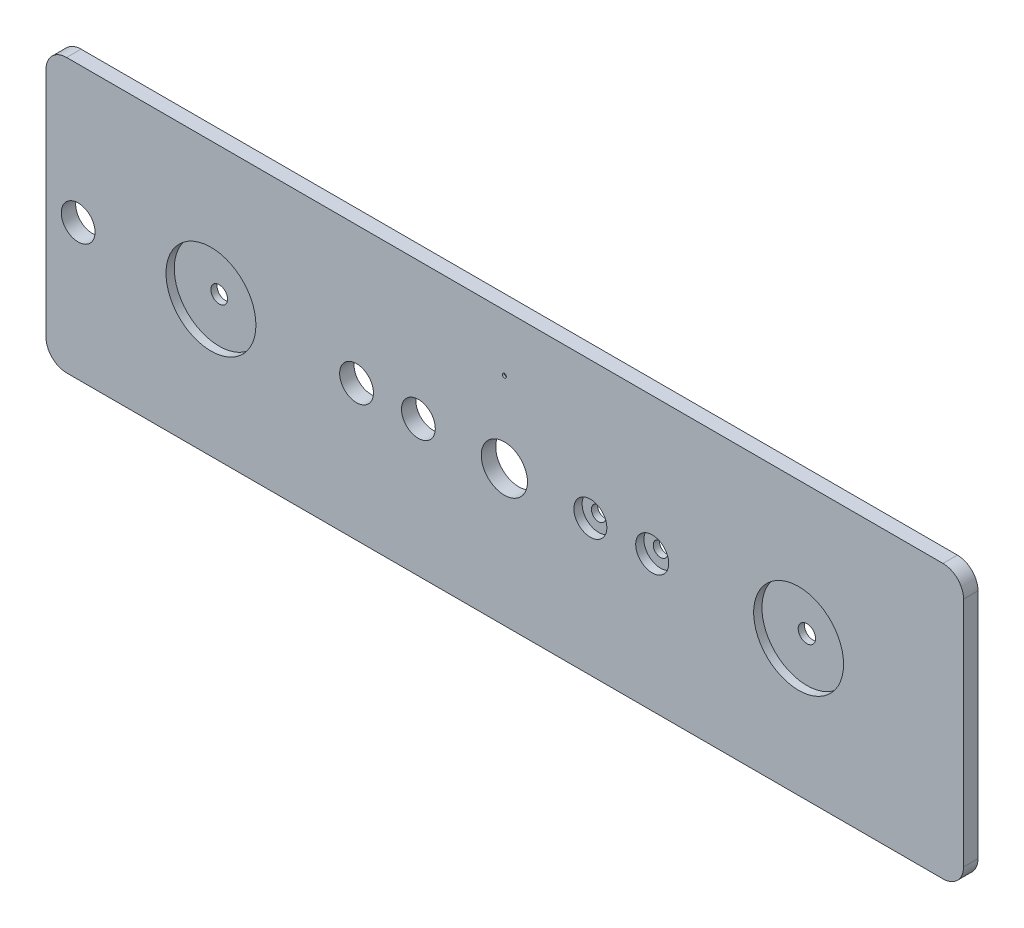
ISO-10303-21;
HEADER;
FILE_DESCRIPTION(('STEP AP214'),'2;1');
FILE_NAME('part.step','',(''),(''),'','','');
FILE_SCHEMA(('AUTOMOTIVE_DESIGN { 1 0 10303 214 1 1 1 1 }'));
ENDSEC;
DATA;
#1=APPLICATION_CONTEXT('core data for automotive mechanical design processes');
#2=APPLICATION_PROTOCOL_DEFINITION('international standard','automotive_design',2000,#1);
#3=PRODUCT_CONTEXT('',#1,'mechanical');
#4=PRODUCT('Part','Part','',(#3));
#5=PRODUCT_RELATED_PRODUCT_CATEGORY('part','',(#4));
#6=PRODUCT_DEFINITION_FORMATION('','',#4);
#7=PRODUCT_DEFINITION_CONTEXT('part definition',#1,'design');
#8=PRODUCT_DEFINITION('design','',#6,#7);
#9=PRODUCT_DEFINITION_SHAPE('','',#8);
#10=(LENGTH_UNIT() NAMED_UNIT(*) SI_UNIT(.MILLI.,.METRE.));
#11=(NAMED_UNIT(*) PLANE_ANGLE_UNIT() SI_UNIT($,.RADIAN.));
#12=(NAMED_UNIT(*) SI_UNIT($,.STERADIAN.) SOLID_ANGLE_UNIT());
#13=UNCERTAINTY_MEASURE_WITH_UNIT(LENGTH_MEASURE(1.E-05),#10,'distance_accuracy_value','');
#14=(GEOMETRIC_REPRESENTATION_CONTEXT(3) GLOBAL_UNCERTAINTY_ASSIGNED_CONTEXT((#13)) GLOBAL_UNIT_ASSIGNED_CONTEXT((#10,
#11,#12)) REPRESENTATION_CONTEXT('',''));
#15=CARTESIAN_POINT('',(0.,0.,0.));
#16=DIRECTION('',(0.,0.,1.));
#17=DIRECTION('',(1.,0.,0.));
#18=AXIS2_PLACEMENT_3D('',#15,#16,#17);
#19=CARTESIAN_POINT('',(222.3,105.,7.));
#20=DIRECTION('',(0.,0.,-1.));
#21=DIRECTION('',(-1.,0.,0.));
#22=AXIS2_PLACEMENT_3D('',#19,#20,#21);
#23=CYLINDRICAL_SURFACE('',#22,0.999999999999998);
#24=CARTESIAN_POINT('',(222.3,105.,7.));
#25=DIRECTION('',(0.,0.,1.));
#26=DIRECTION('',(1.,0.,0.));
#27=AXIS2_PLACEMENT_3D('',#24,#25,#26);
#28=CIRCLE('',#27,0.999999999999998);
#29=CARTESIAN_POINT('',(223.3,105.,7.));
#30=VERTEX_POINT('',#29);
#31=EDGE_CURVE('E204',#30,#30,#28,.T.);
#32=ORIENTED_EDGE('',*,*,#31,.T.);
#33=EDGE_LOOP('',(#32));
#34=FACE_BOUND('',#33,.T.);
#35=CARTESIAN_POINT('',(222.3,105.,6.));
#36=DIRECTION('',(0.,0.,-1.));
#37=DIRECTION('',(-1.,0.,0.));
#38=AXIS2_PLACEMENT_3D('',#35,#36,#37);
#39=CIRCLE('',#38,0.999999999999998);
#40=CARTESIAN_POINT('',(221.3,105.,6.));
#41=VERTEX_POINT('',#40);
#42=EDGE_CURVE('E35',#41,#41,#39,.T.);
#43=ORIENTED_EDGE('',*,*,#42,.T.);
#44=EDGE_LOOP('',(#43));
#45=FACE_BOUND('',#44,.T.);
#46=ADVANCED_FACE('F31',(#34,#45),#23,.F.);
#47=CARTESIAN_POINT('',(294.,66.,7.));
#48=DIRECTION('',(0.,0.,-1.));
#49=DIRECTION('',(-1.,0.,0.));
#50=AXIS2_PLACEMENT_3D('',#47,#48,#49);
#51=CYLINDRICAL_SURFACE('',#50,3.50000000000002);
#52=CARTESIAN_POINT('',(294.,66.,0.));
#53=DIRECTION('',(0.,0.,1.));
#54=DIRECTION('',(1.,0.,0.));
#55=AXIS2_PLACEMENT_3D('',#52,#53,#54);
#56=CIRCLE('',#55,3.50000000000002);
#57=CARTESIAN_POINT('',(297.5,66.,0.));
#58=VERTEX_POINT('',#57);
#59=EDGE_CURVE('E222',#58,#58,#56,.T.);
#60=ORIENTED_EDGE('',*,*,#59,.F.);
#61=EDGE_LOOP('',(#60));
#62=FACE_BOUND('',#61,.T.);
#63=CARTESIAN_POINT('',(294.,66.,3.));
#64=DIRECTION('',(0.,0.,1.));
#65=DIRECTION('',(1.,0.,0.));
#66=AXIS2_PLACEMENT_3D('',#63,#64,#65);
#67=CIRCLE('',#66,3.50000000000002);
#68=CARTESIAN_POINT('',(297.5,66.,3.));
#69=VERTEX_POINT('',#68);
#70=EDGE_CURVE('E172',#69,#69,#67,.T.);
#71=ORIENTED_EDGE('',*,*,#70,.T.);
#72=EDGE_LOOP('',(#71));
#73=FACE_BOUND('',#72,.T.);
#74=ADVANCED_FACE('F275',(#62,#73),#51,.F.);
#75=CARTESIAN_POINT('',(264.,66.,7.));
#76=DIRECTION('',(0.,0.,-1.));
#77=DIRECTION('',(-1.,0.,0.));
#78=AXIS2_PLACEMENT_3D('',#75,#76,#77);
#79=CYLINDRICAL_SURFACE('',#78,3.50000000000002);
#80=CARTESIAN_POINT('',(264.,66.,0.));
#81=DIRECTION('',(0.,0.,1.));
#82=DIRECTION('',(1.,0.,0.));
#83=AXIS2_PLACEMENT_3D('',#80,#81,#82);
#84=CIRCLE('',#83,3.50000000000002);
#85=CARTESIAN_POINT('',(267.5,66.,0.));
#86=VERTEX_POINT('',#85);
#87=EDGE_CURVE('E227',#86,#86,#84,.T.);
#88=ORIENTED_EDGE('',*,*,#87,.F.);
#89=EDGE_LOOP('',(#88));
#90=FACE_BOUND('',#89,.T.);
#91=CARTESIAN_POINT('',(264.,66.,3.));
#92=DIRECTION('',(0.,0.,1.));
#93=DIRECTION('',(1.,0.,0.));
#94=AXIS2_PLACEMENT_3D('',#91,#92,#93);
#95=CIRCLE('',#94,3.50000000000002);
#96=CARTESIAN_POINT('',(267.5,66.,3.));
#97=VERTEX_POINT('',#96);
#98=EDGE_CURVE('E168',#97,#97,#95,.T.);
#99=ORIENTED_EDGE('',*,*,#98,.T.);
#100=EDGE_LOOP('',(#99));
#101=FACE_BOUND('',#100,.T.);
#102=ADVANCED_FACE('F281',(#90,#101),#79,.F.);
#103=CARTESIAN_POINT('',(365.,66.,7.));
#104=DIRECTION('',(0.,0.,-1.));
#105=DIRECTION('',(-1.,0.,0.));
#106=AXIS2_PLACEMENT_3D('',#103,#104,#105);
#107=CYLINDRICAL_SURFACE('',#106,4.19999999999998);
#108=CARTESIAN_POINT('',(365.,66.,0.));
#109=DIRECTION('',(0.,0.,1.));
#110=DIRECTION('',(1.,0.,0.));
#111=AXIS2_PLACEMENT_3D('',#108,#109,#110);
#112=CIRCLE('',#111,4.19999999999998);
#113=CARTESIAN_POINT('',(369.2,66.,0.));
#114=VERTEX_POINT('',#113);
#115=EDGE_CURVE('E213',#114,#114,#112,.T.);
#116=ORIENTED_EDGE('',*,*,#115,.F.);
#117=EDGE_LOOP('',(#116));
#118=FACE_BOUND('',#117,.T.);
#119=CARTESIAN_POINT('',(365.,66.,3.));
#120=DIRECTION('',(0.,0.,1.));
#121=DIRECTION('',(1.,0.,0.));
#122=AXIS2_PLACEMENT_3D('',#119,#120,#121);
#123=CIRCLE('',#122,4.19999999999998);
#124=CARTESIAN_POINT('',(369.2,66.,3.));
#125=VERTEX_POINT('',#124);
#126=EDGE_CURVE('E163',#125,#125,#123,.T.);
#127=ORIENTED_EDGE('',*,*,#126,.T.);
#128=EDGE_LOOP('',(#127));
#129=FACE_BOUND('',#128,.T.);
#130=ADVANCED_FACE('F293',(#118,#129),#107,.F.);
#131=CARTESIAN_POINT('',(80.,66.,7.));
#132=DIRECTION('',(0.,0.,-1.));
#133=DIRECTION('',(-1.,0.,0.));
#134=AXIS2_PLACEMENT_3D('',#131,#132,#133);
#135=CYLINDRICAL_SURFACE('',#134,4.05);
#136=CARTESIAN_POINT('',(80.,66.,0.));
#137=DIRECTION('',(0.,0.,1.));
#138=DIRECTION('',(1.,0.,0.));
#139=AXIS2_PLACEMENT_3D('',#136,#137,#138);
#140=CIRCLE('',#139,4.05);
#141=CARTESIAN_POINT('',(84.05,66.,0.));
#142=VERTEX_POINT('',#141);
#143=EDGE_CURVE('E230',#142,#142,#140,.T.);
#144=ORIENTED_EDGE('',*,*,#143,.F.);
#145=EDGE_LOOP('',(#144));
#146=FACE_BOUND('',#145,.T.);
#147=CARTESIAN_POINT('',(80.,66.,3.));
#148=DIRECTION('',(0.,0.,1.));
#149=DIRECTION('',(1.,0.,0.));
#150=AXIS2_PLACEMENT_3D('',#147,#148,#149);
#151=CIRCLE('',#150,4.05);
#152=CARTESIAN_POINT('',(84.05,66.,3.));
#153=VERTEX_POINT('',#152);
#154=EDGE_CURVE('E158',#153,#153,#151,.T.);
#155=ORIENTED_EDGE('',*,*,#154,.T.);
#156=EDGE_LOOP('',(#155));
#157=FACE_BOUND('',#156,.T.);
#158=ADVANCED_FACE('F296',(#146,#157),#135,.F.);
#159=CARTESIAN_POINT('',(10.,122.5,7.));
#160=DIRECTION('',(0.,0.,-1.));
#161=DIRECTION('',(-1.,0.,0.));
#162=AXIS2_PLACEMENT_3D('',#159,#160,#161);
#163=PLANE('',#162);
#164=CARTESIAN_POINT('',(294.,66.,7.));
#165=DIRECTION('',(0.,0.,1.));
#166=DIRECTION('',(1.,0.,0.));
#167=AXIS2_PLACEMENT_3D('',#164,#165,#166);
#168=CIRCLE('',#167,7.99999999999999);
#169=CARTESIAN_POINT('',(302.,66.,7.));
#170=VERTEX_POINT('',#169);
#171=EDGE_CURVE('E181',#170,#170,#168,.T.);
#172=ORIENTED_EDGE('',*,*,#171,.F.);
#173=EDGE_LOOP('',(#172));
#174=FACE_BOUND('',#173,.T.);
#175=CARTESIAN_POINT('',(264.,66.,7.));
#176=DIRECTION('',(0.,0.,1.));
#177=DIRECTION('',(1.,0.,0.));
#178=AXIS2_PLACEMENT_3D('',#175,#176,#177);
#179=CIRCLE('',#178,7.99999999999999);
#180=CARTESIAN_POINT('',(272.,66.,7.));
#181=VERTEX_POINT('',#180);
#182=EDGE_CURVE('E174',#181,#181,#179,.T.);
#183=ORIENTED_EDGE('',*,*,#182,.F.);
#184=EDGE_LOOP('',(#183));
#185=FACE_BOUND('',#184,.T.);
#186=CARTESIAN_POINT('',(365.,66.,7.));
#187=DIRECTION('',(0.,0.,1.));
#188=DIRECTION('',(1.,0.,0.));
#189=AXIS2_PLACEMENT_3D('',#186,#187,#188);
#190=CIRCLE('',#189,21.8);
#191=CARTESIAN_POINT('',(386.8,66.,7.));
#192=VERTEX_POINT('',#191);
#193=EDGE_CURVE('E170',#192,#192,#190,.T.);
#194=ORIENTED_EDGE('',*,*,#193,.F.);
#195=EDGE_LOOP('',(#194));
#196=FACE_BOUND('',#195,.T.);
#197=CARTESIAN_POINT('',(80.,66.,7.));
#198=DIRECTION('',(0.,0.,1.));
#199=DIRECTION('',(1.,0.,0.));
#200=AXIS2_PLACEMENT_3D('',#197,#198,#199);
#201=CIRCLE('',#200,21.8);
#202=CARTESIAN_POINT('',(101.8,66.,7.));
#203=VERTEX_POINT('',#202);
#204=EDGE_CURVE('E166',#203,#203,#201,.T.);
#205=ORIENTED_EDGE('',*,*,#204,.F.);
#206=EDGE_LOOP('',(#205));
#207=FACE_BOUND('',#206,.T.);
#208=ORIENTED_EDGE('',*,*,#31,.F.);
#209=EDGE_LOOP('',(#208));
#210=FACE_BOUND('',#209,.T.);
#211=CARTESIAN_POINT('',(10.,122.5,7.));
#212=DIRECTION('',(0.,0.,1.));
#213=DIRECTION('',(-1.,0.,0.));
#214=AXIS2_PLACEMENT_3D('',#211,#212,#213);
#215=CIRCLE('',#214,10.);
#216=CARTESIAN_POINT('',(10.0000000000001,132.5,7.));
#217=VERTEX_POINT('',#216);
#218=CARTESIAN_POINT('',(0.,122.5,7.));
#219=VERTEX_POINT('',#218);
#220=EDGE_CURVE('E146',#217,#219,#215,.T.);
#221=ORIENTED_EDGE('',*,*,#220,.T.);
#222=DIRECTION('',(0.,-1.,0.));
#223=VECTOR('',#222,1.);
#224=CARTESIAN_POINT('',(0.,10.0000000000001,7.));
#225=LINE('',#224,#223);
#226=CARTESIAN_POINT('',(0.,10.0000000000001,7.));
#227=VERTEX_POINT('',#226);
#228=EDGE_CURVE('E93',#219,#227,#225,.T.);
#229=ORIENTED_EDGE('',*,*,#228,.T.);
#230=CARTESIAN_POINT('',(10.,10.,7.));
#231=DIRECTION('',(0.,0.,1.));
#232=DIRECTION('',(-1.,0.,0.));
#233=AXIS2_PLACEMENT_3D('',#230,#231,#232);
#234=CIRCLE('',#233,10.);
#235=CARTESIAN_POINT('',(10.0000000000001,0.,7.));
#236=VERTEX_POINT('',#235);
#237=EDGE_CURVE('E240',#227,#236,#234,.T.);
#238=ORIENTED_EDGE('',*,*,#237,.T.);
#239=DIRECTION('',(1.,0.,0.));
#240=VECTOR('',#239,1.);
#241=CARTESIAN_POINT('',(10.0000000000001,0.,7.));
#242=LINE('',#241,#240);
#243=CARTESIAN_POINT('',(435.,0.,7.));
#244=VERTEX_POINT('',#243);
#245=EDGE_CURVE('E242',#236,#244,#242,.T.);
#246=ORIENTED_EDGE('',*,*,#245,.T.);
#247=CARTESIAN_POINT('',(435.,10.,7.));
#248=DIRECTION('',(0.,0.,1.));
#249=DIRECTION('',(1.,0.,0.));
#250=AXIS2_PLACEMENT_3D('',#247,#248,#249);
#251=CIRCLE('',#250,10.);
#252=CARTESIAN_POINT('',(445.,10.0000000000001,7.));
#253=VERTEX_POINT('',#252);
#254=EDGE_CURVE('E113',#244,#253,#251,.T.);
#255=ORIENTED_EDGE('',*,*,#254,.T.);
#256=DIRECTION('',(0.,1.,0.));
#257=VECTOR('',#256,1.);
#258=CARTESIAN_POINT('',(445.,10.0000000000001,7.));
#259=LINE('',#258,#257);
#260=CARTESIAN_POINT('',(445.,122.5,7.));
#261=VERTEX_POINT('',#260);
#262=EDGE_CURVE('E106',#253,#261,#259,.T.);
#263=ORIENTED_EDGE('',*,*,#262,.T.);
#264=CARTESIAN_POINT('',(435.,122.5,7.));
#265=DIRECTION('',(0.,0.,1.));
#266=DIRECTION('',(-1.,0.,0.));
#267=AXIS2_PLACEMENT_3D('',#264,#265,#266);
#268=CIRCLE('',#267,10.);
#269=CARTESIAN_POINT('',(435.,132.5,7.));
#270=VERTEX_POINT('',#269);
#271=EDGE_CURVE('E111',#261,#270,#268,.T.);
#272=ORIENTED_EDGE('',*,*,#271,.T.);
#273=DIRECTION('',(-1.,0.,0.));
#274=VECTOR('',#273,1.);
#275=CARTESIAN_POINT('',(10.0000000000001,132.5,7.));
#276=LINE('',#275,#274);
#277=EDGE_CURVE('E50',#270,#217,#276,.T.);
#278=ORIENTED_EDGE('',*,*,#277,.T.);
#279=EDGE_LOOP('',(#221,#229,#238,#246,#255,#263,#272,#278));
#280=FACE_BOUND('',#279,.T.);
#281=CARTESIAN_POINT('',(222.3,66.,7.));
#282=DIRECTION('',(0.,0.,1.));
#283=DIRECTION('',(1.,0.,0.));
#284=AXIS2_PLACEMENT_3D('',#281,#282,#283);
#285=CIRCLE('',#284,11.2);
#286=CARTESIAN_POINT('',(233.5,66.,7.));
#287=VERTEX_POINT('',#286);
#288=EDGE_CURVE('E135',#287,#287,#285,.T.);
#289=ORIENTED_EDGE('',*,*,#288,.F.);
#290=EDGE_LOOP('',(#289));
#291=FACE_BOUND('',#290,.T.);
#292=CARTESIAN_POINT('',(180.6,66.,7.));
#293=DIRECTION('',(0.,0.,1.));
#294=DIRECTION('',(1.,0.,0.));
#295=AXIS2_PLACEMENT_3D('',#292,#293,#294);
#296=CIRCLE('',#295,8.19999999999997);
#297=CARTESIAN_POINT('',(188.8,66.,7.));
#298=VERTEX_POINT('',#297);
#299=EDGE_CURVE('E219',#298,#298,#296,.T.);
#300=ORIENTED_EDGE('',*,*,#299,.F.);
#301=EDGE_LOOP('',(#300));
#302=FACE_BOUND('',#301,.T.);
#303=CARTESIAN_POINT('',(15.6,66.,7.));
#304=DIRECTION('',(0.,0.,1.));
#305=DIRECTION('',(1.,0.,0.));
#306=AXIS2_PLACEMENT_3D('',#303,#304,#305);
#307=CIRCLE('',#306,8.2);
#308=CARTESIAN_POINT('',(23.8,66.,7.));
#309=VERTEX_POINT('',#308);
#310=EDGE_CURVE('E210',#309,#309,#307,.T.);
#311=ORIENTED_EDGE('',*,*,#310,.F.);
#312=EDGE_LOOP('',(#311));
#313=FACE_BOUND('',#312,.T.);
#314=CARTESIAN_POINT('',(150.6,66.,7.));
#315=DIRECTION('',(0.,0.,1.));
#316=DIRECTION('',(1.,0.,0.));
#317=AXIS2_PLACEMENT_3D('',#314,#315,#316);
#318=CIRCLE('',#317,8.2);
#319=CARTESIAN_POINT('',(158.8,66.,7.));
#320=VERTEX_POINT('',#319);
#321=EDGE_CURVE('E201',#320,#320,#318,.T.);
#322=ORIENTED_EDGE('',*,*,#321,.F.);
#323=EDGE_LOOP('',(#322));
#324=FACE_BOUND('',#323,.T.);
#325=ADVANCED_FACE('F108',(#174,#185,#196,#207,#210,#280,#291,#302,#313,#324),#163,.F.);
#326=CARTESIAN_POINT('',(10.,122.5,0.));
#327=DIRECTION('',(0.,0.,-1.));
#328=DIRECTION('',(-1.,0.,0.));
#329=AXIS2_PLACEMENT_3D('',#326,#327,#328);
#330=PLANE('',#329);
#331=CARTESIAN_POINT('',(428.,118.4,0.));
#332=DIRECTION('',(0.,0.,-1.));
#333=DIRECTION('',(-1.,0.,0.));
#334=AXIS2_PLACEMENT_3D('',#331,#332,#333);
#335=CIRCLE('',#334,1.74999999999998);
#336=CARTESIAN_POINT('',(426.25,118.4,0.));
#337=VERTEX_POINT('',#336);
#338=EDGE_CURVE('E318',#337,#337,#335,.T.);
#339=ORIENTED_EDGE('',*,*,#338,.F.);
#340=EDGE_LOOP('',(#339));
#341=FACE_BOUND('',#340,.T.);
#342=CARTESIAN_POINT('',(428.,14.1,0.));
#343=DIRECTION('',(0.,0.,-1.));
#344=DIRECTION('',(-1.,0.,0.));
#345=AXIS2_PLACEMENT_3D('',#342,#343,#344);
#346=CIRCLE('',#345,1.74999999999998);
#347=CARTESIAN_POINT('',(426.25,14.1,0.));
#348=VERTEX_POINT('',#347);
#349=EDGE_CURVE('E322',#348,#348,#346,.T.);
#350=ORIENTED_EDGE('',*,*,#349,.F.);
#351=EDGE_LOOP('',(#350));
#352=FACE_BOUND('',#351,.T.);
#353=CARTESIAN_POINT('',(17.,14.1,0.));
#354=DIRECTION('',(0.,0.,-1.));
#355=DIRECTION('',(-1.,0.,0.));
#356=AXIS2_PLACEMENT_3D('',#353,#354,#355);
#357=CIRCLE('',#356,1.75);
#358=CARTESIAN_POINT('',(15.25,14.1,0.));
#359=VERTEX_POINT('',#358);
#360=EDGE_CURVE('E326',#359,#359,#357,.T.);
#361=ORIENTED_EDGE('',*,*,#360,.F.);
#362=EDGE_LOOP('',(#361));
#363=FACE_BOUND('',#362,.T.);
#364=CARTESIAN_POINT('',(17.,118.4,0.));
#365=DIRECTION('',(0.,0.,-1.));
#366=DIRECTION('',(-1.,0.,0.));
#367=AXIS2_PLACEMENT_3D('',#364,#365,#366);
#368=CIRCLE('',#367,1.75);
#369=CARTESIAN_POINT('',(15.25,118.4,0.));
#370=VERTEX_POINT('',#369);
#371=EDGE_CURVE('E330',#370,#370,#368,.T.);
#372=ORIENTED_EDGE('',*,*,#371,.F.);
#373=EDGE_LOOP('',(#372));
#374=FACE_BOUND('',#373,.T.);
#375=CARTESIAN_POINT('',(222.3,105.,0.));
#376=DIRECTION('',(0.,0.,-1.));
#377=DIRECTION('',(-1.,0.,0.));
#378=AXIS2_PLACEMENT_3D('',#375,#376,#377);
#379=CIRCLE('',#378,2.99999999999999);
#380=CARTESIAN_POINT('',(219.3,105.,0.));
#381=VERTEX_POINT('',#380);
#382=EDGE_CURVE('E188',#381,#381,#379,.T.);
#383=ORIENTED_EDGE('',*,*,#382,.F.);
#384=EDGE_LOOP('',(#383));
#385=FACE_BOUND('',#384,.T.);
#386=ORIENTED_EDGE('',*,*,#115,.T.);
#387=EDGE_LOOP('',(#386));
#388=FACE_BOUND('',#387,.T.);
#389=ORIENTED_EDGE('',*,*,#59,.T.);
#390=EDGE_LOOP('',(#389));
#391=FACE_BOUND('',#390,.T.);
#392=ORIENTED_EDGE('',*,*,#143,.T.);
#393=EDGE_LOOP('',(#392));
#394=FACE_BOUND('',#393,.T.);
#395=CARTESIAN_POINT('',(10.,122.5,0.));
#396=DIRECTION('',(0.,0.,1.));
#397=DIRECTION('',(-1.,0.,0.));
#398=AXIS2_PLACEMENT_3D('',#395,#396,#397);
#399=CIRCLE('',#398,10.);
#400=CARTESIAN_POINT('',(10.0000000000001,132.5,0.));
#401=VERTEX_POINT('',#400);
#402=CARTESIAN_POINT('',(0.,122.5,0.));
#403=VERTEX_POINT('',#402);
#404=EDGE_CURVE('E131',#401,#403,#399,.T.);
#405=ORIENTED_EDGE('',*,*,#404,.F.);
#406=DIRECTION('',(-1.,0.,0.));
#407=VECTOR('',#406,1.);
#408=CARTESIAN_POINT('',(10.0000000000001,132.5,0.));
#409=LINE('',#408,#407);
#410=CARTESIAN_POINT('',(435.,132.5,0.));
#411=VERTEX_POINT('',#410);
#412=EDGE_CURVE('E85',#411,#401,#409,.T.);
#413=ORIENTED_EDGE('',*,*,#412,.F.);
#414=CARTESIAN_POINT('',(435.,122.5,0.));
#415=DIRECTION('',(0.,0.,1.));
#416=DIRECTION('',(-1.,0.,0.));
#417=AXIS2_PLACEMENT_3D('',#414,#415,#416);
#418=CIRCLE('',#417,10.);
#419=CARTESIAN_POINT('',(445.,122.5,0.));
#420=VERTEX_POINT('',#419);
#421=EDGE_CURVE('E79',#420,#411,#418,.T.);
#422=ORIENTED_EDGE('',*,*,#421,.F.);
#423=DIRECTION('',(0.,1.,0.));
#424=VECTOR('',#423,1.);
#425=CARTESIAN_POINT('',(445.,10.0000000000001,0.));
#426=LINE('',#425,#424);
#427=CARTESIAN_POINT('',(445.,10.0000000000001,0.));
#428=VERTEX_POINT('',#427);
#429=EDGE_CURVE('E121',#428,#420,#426,.T.);
#430=ORIENTED_EDGE('',*,*,#429,.F.);
#431=CARTESIAN_POINT('',(435.,10.,0.));
#432=DIRECTION('',(0.,0.,1.));
#433=DIRECTION('',(1.,0.,0.));
#434=AXIS2_PLACEMENT_3D('',#431,#432,#433);
#435=CIRCLE('',#434,10.);
#436=CARTESIAN_POINT('',(435.,0.,0.));
#437=VERTEX_POINT('',#436);
#438=EDGE_CURVE('E141',#437,#428,#435,.T.);
#439=ORIENTED_EDGE('',*,*,#438,.F.);
#440=DIRECTION('',(1.,0.,0.));
#441=VECTOR('',#440,1.);
#442=CARTESIAN_POINT('',(10.0000000000001,0.,0.));
#443=LINE('',#442,#441);
#444=CARTESIAN_POINT('',(10.0000000000001,0.,0.));
#445=VERTEX_POINT('',#444);
#446=EDGE_CURVE('E139',#445,#437,#443,.T.);
#447=ORIENTED_EDGE('',*,*,#446,.F.);
#448=CARTESIAN_POINT('',(10.,10.,0.));
#449=DIRECTION('',(0.,0.,1.));
#450=DIRECTION('',(-1.,0.,0.));
#451=AXIS2_PLACEMENT_3D('',#448,#449,#450);
#452=CIRCLE('',#451,10.);
#453=CARTESIAN_POINT('',(0.,10.0000000000001,0.));
#454=VERTEX_POINT('',#453);
#455=EDGE_CURVE('E137',#454,#445,#452,.T.);
#456=ORIENTED_EDGE('',*,*,#455,.F.);
#457=DIRECTION('',(0.,-1.,0.));
#458=VECTOR('',#457,1.);
#459=CARTESIAN_POINT('',(0.,10.0000000000001,0.));
#460=LINE('',#459,#458);
#461=EDGE_CURVE('E134',#403,#454,#460,.T.);
#462=ORIENTED_EDGE('',*,*,#461,.F.);
#463=EDGE_LOOP('',(#405,#413,#422,#430,#439,#447,#456,#462));
#464=FACE_BOUND('',#463,.T.);
#465=CARTESIAN_POINT('',(222.3,66.,0.));
#466=DIRECTION('',(0.,0.,1.));
#467=DIRECTION('',(1.,0.,0.));
#468=AXIS2_PLACEMENT_3D('',#465,#466,#467);
#469=CIRCLE('',#468,11.2);
#470=CARTESIAN_POINT('',(233.5,66.,0.));
#471=VERTEX_POINT('',#470);
#472=EDGE_CURVE('E233',#471,#471,#469,.T.);
#473=ORIENTED_EDGE('',*,*,#472,.T.);
#474=EDGE_LOOP('',(#473));
#475=FACE_BOUND('',#474,.T.);
#476=ORIENTED_EDGE('',*,*,#87,.T.);
#477=EDGE_LOOP('',(#476));
#478=FACE_BOUND('',#477,.T.);
#479=CARTESIAN_POINT('',(180.6,66.,0.));
#480=DIRECTION('',(0.,0.,1.));
#481=DIRECTION('',(1.,0.,0.));
#482=AXIS2_PLACEMENT_3D('',#479,#480,#481);
#483=CIRCLE('',#482,8.19999999999997);
#484=CARTESIAN_POINT('',(188.8,66.,0.));
#485=VERTEX_POINT('',#484);
#486=EDGE_CURVE('E218',#485,#485,#483,.T.);
#487=ORIENTED_EDGE('',*,*,#486,.T.);
#488=EDGE_LOOP('',(#487));
#489=FACE_BOUND('',#488,.T.);
#490=CARTESIAN_POINT('',(15.6,66.,0.));
#491=DIRECTION('',(0.,0.,1.));
#492=DIRECTION('',(1.,0.,0.));
#493=AXIS2_PLACEMENT_3D('',#490,#491,#492);
#494=CIRCLE('',#493,8.2);
#495=CARTESIAN_POINT('',(23.8,66.,0.));
#496=VERTEX_POINT('',#495);
#497=EDGE_CURVE('E209',#496,#496,#494,.T.);
#498=ORIENTED_EDGE('',*,*,#497,.T.);
#499=EDGE_LOOP('',(#498));
#500=FACE_BOUND('',#499,.T.);
#501=CARTESIAN_POINT('',(150.6,66.,0.));
#502=DIRECTION('',(0.,0.,1.));
#503=DIRECTION('',(1.,0.,0.));
#504=AXIS2_PLACEMENT_3D('',#501,#502,#503);
#505=CIRCLE('',#504,8.2);
#506=CARTESIAN_POINT('',(158.8,66.,0.));
#507=VERTEX_POINT('',#506);
#508=EDGE_CURVE('E161',#507,#507,#505,.T.);
#509=ORIENTED_EDGE('',*,*,#508,.T.);
#510=EDGE_LOOP('',(#509));
#511=FACE_BOUND('',#510,.T.);
#512=ADVANCED_FACE('F255',(#341,#352,#363,#374,#385,#388,#391,#394,#464,#475,#478,#489,#500,
#511),#330,.T.);
#513=CARTESIAN_POINT('',(10.,122.5,7.));
#514=DIRECTION('',(0.,0.,-1.));
#515=DIRECTION('',(-1.,0.,0.));
#516=AXIS2_PLACEMENT_3D('',#513,#514,#515);
#517=CYLINDRICAL_SURFACE('',#516,10.);
#518=ORIENTED_EDGE('',*,*,#404,.T.);
#519=DIRECTION('',(0.,0.,-1.));
#520=VECTOR('',#519,1.);
#521=CARTESIAN_POINT('',(0.,122.5,7.));
#522=LINE('',#521,#520);
#523=EDGE_CURVE('E11',#219,#403,#522,.T.);
#524=ORIENTED_EDGE('',*,*,#523,.F.);
#525=ORIENTED_EDGE('',*,*,#220,.F.);
#526=DIRECTION('',(0.,0.,-1.));
#527=VECTOR('',#526,1.);
#528=CARTESIAN_POINT('',(10.0000000000001,132.5,7.));
#529=LINE('',#528,#527);
#530=EDGE_CURVE('E127',#217,#401,#529,.T.);
#531=ORIENTED_EDGE('',*,*,#530,.T.);
#532=EDGE_LOOP('',(#518,#524,#525,#531));
#533=FACE_BOUND('',#532,.T.);
#534=ADVANCED_FACE('F33',(#533),#517,.T.);
#535=CARTESIAN_POINT('',(0.,10.0000000000001,7.));
#536=DIRECTION('',(1.,0.,0.));
#537=DIRECTION('',(0.,0.,-1.));
#538=AXIS2_PLACEMENT_3D('',#535,#536,#537);
#539=PLANE('',#538);
#540=ORIENTED_EDGE('',*,*,#461,.T.);
#541=DIRECTION('',(0.,0.,-1.));
#542=VECTOR('',#541,1.);
#543=CARTESIAN_POINT('',(0.,10.0000000000001,7.));
#544=LINE('',#543,#542);
#545=EDGE_CURVE('E41',#227,#454,#544,.T.);
#546=ORIENTED_EDGE('',*,*,#545,.F.);
#547=ORIENTED_EDGE('',*,*,#228,.F.);
#548=ORIENTED_EDGE('',*,*,#523,.T.);
#549=EDGE_LOOP('',(#540,#546,#547,#548));
#550=FACE_BOUND('',#549,.T.);
#551=ADVANCED_FACE('F314',(#550),#539,.F.);
#552=CARTESIAN_POINT('',(10.,10.,7.));
#553=DIRECTION('',(0.,0.,-1.));
#554=DIRECTION('',(-1.,0.,0.));
#555=AXIS2_PLACEMENT_3D('',#552,#553,#554);
#556=CYLINDRICAL_SURFACE('',#555,10.);
#557=ORIENTED_EDGE('',*,*,#455,.T.);
#558=DIRECTION('',(0.,0.,-1.));
#559=VECTOR('',#558,1.);
#560=CARTESIAN_POINT('',(10.0000000000001,0.,7.));
#561=LINE('',#560,#559);
#562=EDGE_CURVE('E153',#236,#445,#561,.T.);
#563=ORIENTED_EDGE('',*,*,#562,.F.);
#564=ORIENTED_EDGE('',*,*,#237,.F.);
#565=ORIENTED_EDGE('',*,*,#545,.T.);
#566=EDGE_LOOP('',(#557,#563,#564,#565));
#567=FACE_BOUND('',#566,.T.);
#568=ADVANCED_FACE('F614',(#567),#556,.T.);
#569=CARTESIAN_POINT('',(10.0000000000001,0.,7.));
#570=DIRECTION('',(0.,1.,0.));
#571=DIRECTION('',(0.,0.,1.));
#572=AXIS2_PLACEMENT_3D('',#569,#570,#571);
#573=PLANE('',#572);
#574=ORIENTED_EDGE('',*,*,#446,.T.);
#575=DIRECTION('',(0.,0.,-1.));
#576=VECTOR('',#575,1.);
#577=CARTESIAN_POINT('',(435.,0.,7.));
#578=LINE('',#577,#576);
#579=EDGE_CURVE('E150',#244,#437,#578,.T.);
#580=ORIENTED_EDGE('',*,*,#579,.F.);
#581=ORIENTED_EDGE('',*,*,#245,.F.);
#582=ORIENTED_EDGE('',*,*,#562,.T.);
#583=EDGE_LOOP('',(#574,#580,#581,#582));
#584=FACE_BOUND('',#583,.T.);
#585=ADVANCED_FACE('F248',(#584),#573,.F.);
#586=CARTESIAN_POINT('',(435.,10.,7.));
#587=DIRECTION('',(0.,0.,-1.));
#588=DIRECTION('',(-1.,0.,0.));
#589=AXIS2_PLACEMENT_3D('',#586,#587,#588);
#590=CYLINDRICAL_SURFACE('',#589,10.);
#591=ORIENTED_EDGE('',*,*,#438,.T.);
#592=DIRECTION('',(0.,0.,-1.));
#593=VECTOR('',#592,1.);
#594=CARTESIAN_POINT('',(445.,10.0000000000001,7.));
#595=LINE('',#594,#593);
#596=EDGE_CURVE('E122',#253,#428,#595,.T.);
#597=ORIENTED_EDGE('',*,*,#596,.F.);
#598=ORIENTED_EDGE('',*,*,#254,.F.);
#599=ORIENTED_EDGE('',*,*,#579,.T.);
#600=EDGE_LOOP('',(#591,#597,#598,#599));
#601=FACE_BOUND('',#600,.T.);
#602=ADVANCED_FACE('F252',(#601),#590,.T.);
#603=CARTESIAN_POINT('',(445.,10.0000000000001,7.));
#604=DIRECTION('',(-1.,0.,0.));
#605=DIRECTION('',(0.,0.,1.));
#606=AXIS2_PLACEMENT_3D('',#603,#604,#605);
#607=PLANE('',#606);
#608=ORIENTED_EDGE('',*,*,#429,.T.);
#609=DIRECTION('',(0.,0.,-1.));
#610=VECTOR('',#609,1.);
#611=CARTESIAN_POINT('',(445.,122.5,7.));
#612=LINE('',#611,#610);
#613=EDGE_CURVE('E118',#261,#420,#612,.T.);
#614=ORIENTED_EDGE('',*,*,#613,.F.);
#615=ORIENTED_EDGE('',*,*,#262,.F.);
#616=ORIENTED_EDGE('',*,*,#596,.T.);
#617=EDGE_LOOP('',(#608,#614,#615,#616));
#618=FACE_BOUND('',#617,.T.);
#619=ADVANCED_FACE('F119',(#618),#607,.F.);
#620=CARTESIAN_POINT('',(435.,122.5,7.));
#621=DIRECTION('',(0.,0.,-1.));
#622=DIRECTION('',(-1.,0.,0.));
#623=AXIS2_PLACEMENT_3D('',#620,#621,#622);
#624=CYLINDRICAL_SURFACE('',#623,10.);
#625=ORIENTED_EDGE('',*,*,#421,.T.);
#626=DIRECTION('',(0.,0.,-1.));
#627=VECTOR('',#626,1.);
#628=CARTESIAN_POINT('',(435.,132.5,7.));
#629=LINE('',#628,#627);
#630=EDGE_CURVE('E123',#270,#411,#629,.T.);
#631=ORIENTED_EDGE('',*,*,#630,.F.);
#632=ORIENTED_EDGE('',*,*,#271,.F.);
#633=ORIENTED_EDGE('',*,*,#613,.T.);
#634=EDGE_LOOP('',(#625,#631,#632,#633));
#635=FACE_BOUND('',#634,.T.);
#636=ADVANCED_FACE('F125',(#635),#624,.T.);
#637=CARTESIAN_POINT('',(10.0000000000001,132.5,7.));
#638=DIRECTION('',(0.,-1.,0.));
#639=DIRECTION('',(0.,0.,-1.));
#640=AXIS2_PLACEMENT_3D('',#637,#638,#639);
#641=PLANE('',#640);
#642=ORIENTED_EDGE('',*,*,#412,.T.);
#643=ORIENTED_EDGE('',*,*,#530,.F.);
#644=ORIENTED_EDGE('',*,*,#277,.F.);
#645=ORIENTED_EDGE('',*,*,#630,.T.);
#646=EDGE_LOOP('',(#642,#643,#644,#645));
#647=FACE_BOUND('',#646,.T.);
#648=ADVANCED_FACE('F261',(#647),#641,.F.);
#649=CARTESIAN_POINT('',(222.3,66.,7.));
#650=DIRECTION('',(0.,0.,-1.));
#651=DIRECTION('',(-1.,0.,0.));
#652=AXIS2_PLACEMENT_3D('',#649,#650,#651);
#653=CYLINDRICAL_SURFACE('',#652,11.2);
#654=ORIENTED_EDGE('',*,*,#288,.T.);
#655=EDGE_LOOP('',(#654));
#656=FACE_BOUND('',#655,.T.);
#657=ORIENTED_EDGE('',*,*,#472,.F.);
#658=EDGE_LOOP('',(#657));
#659=FACE_BOUND('',#658,.T.);
#660=ADVANCED_FACE('F263',(#656,#659),#653,.F.);
#661=CARTESIAN_POINT('',(180.6,66.,7.));
#662=DIRECTION('',(0.,0.,-1.));
#663=DIRECTION('',(-1.,0.,0.));
#664=AXIS2_PLACEMENT_3D('',#661,#662,#663);
#665=CYLINDRICAL_SURFACE('',#664,8.19999999999997);
#666=ORIENTED_EDGE('',*,*,#299,.T.);
#667=EDGE_LOOP('',(#666));
#668=FACE_BOUND('',#667,.T.);
#669=ORIENTED_EDGE('',*,*,#486,.F.);
#670=EDGE_LOOP('',(#669));
#671=FACE_BOUND('',#670,.T.);
#672=ADVANCED_FACE('F269',(#668,#671),#665,.F.);
#673=CARTESIAN_POINT('',(15.6,66.,7.));
#674=DIRECTION('',(0.,0.,-1.));
#675=DIRECTION('',(-1.,0.,0.));
#676=AXIS2_PLACEMENT_3D('',#673,#674,#675);
#677=CYLINDRICAL_SURFACE('',#676,8.2);
#678=ORIENTED_EDGE('',*,*,#310,.T.);
#679=EDGE_LOOP('',(#678));
#680=FACE_BOUND('',#679,.T.);
#681=ORIENTED_EDGE('',*,*,#497,.F.);
#682=EDGE_LOOP('',(#681));
#683=FACE_BOUND('',#682,.T.);
#684=ADVANCED_FACE('F289',(#680,#683),#677,.F.);
#685=CARTESIAN_POINT('',(150.6,66.,7.));
#686=DIRECTION('',(0.,0.,-1.));
#687=DIRECTION('',(-1.,0.,0.));
#688=AXIS2_PLACEMENT_3D('',#685,#686,#687);
#689=CYLINDRICAL_SURFACE('',#688,8.2);
#690=ORIENTED_EDGE('',*,*,#321,.T.);
#691=EDGE_LOOP('',(#690));
#692=FACE_BOUND('',#691,.T.);
#693=ORIENTED_EDGE('',*,*,#508,.F.);
#694=EDGE_LOOP('',(#693));
#695=FACE_BOUND('',#694,.T.);
#696=ADVANCED_FACE('F287',(#692,#695),#689,.F.);
#697=CARTESIAN_POINT('',(80.,66.,3.));
#698=DIRECTION('',(0.,0.,1.));
#699=DIRECTION('',(1.,0.,0.));
#700=AXIS2_PLACEMENT_3D('',#697,#698,#699);
#701=CYLINDRICAL_SURFACE('',#700,21.8);
#702=CARTESIAN_POINT('',(80.,66.,3.));
#703=DIRECTION('',(0.,0.,1.));
#704=DIRECTION('',(1.,0.,0.));
#705=AXIS2_PLACEMENT_3D('',#702,#703,#704);
#706=CIRCLE('',#705,21.8);
#707=CARTESIAN_POINT('',(101.8,66.,3.));
#708=VERTEX_POINT('',#707);
#709=EDGE_CURVE('E162',#708,#708,#706,.T.);
#710=ORIENTED_EDGE('',*,*,#709,.F.);
#711=EDGE_LOOP('',(#710));
#712=FACE_BOUND('',#711,.T.);
#713=ORIENTED_EDGE('',*,*,#204,.T.);
#714=EDGE_LOOP('',(#713));
#715=FACE_BOUND('',#714,.T.);
#716=ADVANCED_FACE('F346',(#712,#715),#701,.F.);
#717=CARTESIAN_POINT('',(80.,66.,3.));
#718=DIRECTION('',(0.,0.,1.));
#719=DIRECTION('',(1.,0.,0.));
#720=AXIS2_PLACEMENT_3D('',#717,#718,#719);
#721=PLANE('',#720);
#722=ORIENTED_EDGE('',*,*,#154,.F.);
#723=EDGE_LOOP('',(#722));
#724=FACE_BOUND('',#723,.T.);
#725=ORIENTED_EDGE('',*,*,#709,.T.);
#726=EDGE_LOOP('',(#725));
#727=FACE_BOUND('',#726,.T.);
#728=ADVANCED_FACE('F342',(#724,#727),#721,.T.);
#729=CARTESIAN_POINT('',(365.,66.,3.));
#730=DIRECTION('',(0.,0.,1.));
#731=DIRECTION('',(1.,0.,0.));
#732=AXIS2_PLACEMENT_3D('',#729,#730,#731);
#733=CYLINDRICAL_SURFACE('',#732,21.8);
#734=CARTESIAN_POINT('',(365.,66.,3.));
#735=DIRECTION('',(0.,0.,1.));
#736=DIRECTION('',(1.,0.,0.));
#737=AXIS2_PLACEMENT_3D('',#734,#735,#736);
#738=CIRCLE('',#737,21.8);
#739=CARTESIAN_POINT('',(386.8,66.,3.));
#740=VERTEX_POINT('',#739);
#741=EDGE_CURVE('E167',#740,#740,#738,.T.);
#742=ORIENTED_EDGE('',*,*,#741,.F.);
#743=EDGE_LOOP('',(#742));
#744=FACE_BOUND('',#743,.T.);
#745=ORIENTED_EDGE('',*,*,#193,.T.);
#746=EDGE_LOOP('',(#745));
#747=FACE_BOUND('',#746,.T.);
#748=ADVANCED_FACE('F345',(#744,#747),#733,.F.);
#749=CARTESIAN_POINT('',(365.,66.,3.));
#750=DIRECTION('',(0.,0.,1.));
#751=DIRECTION('',(1.,0.,0.));
#752=AXIS2_PLACEMENT_3D('',#749,#750,#751);
#753=PLANE('',#752);
#754=ORIENTED_EDGE('',*,*,#126,.F.);
#755=EDGE_LOOP('',(#754));
#756=FACE_BOUND('',#755,.T.);
#757=ORIENTED_EDGE('',*,*,#741,.T.);
#758=EDGE_LOOP('',(#757));
#759=FACE_BOUND('',#758,.T.);
#760=ADVANCED_FACE('F363',(#756,#759),#753,.T.);
#761=CARTESIAN_POINT('',(264.,66.,3.));
#762=DIRECTION('',(0.,0.,1.));
#763=DIRECTION('',(1.,0.,0.));
#764=AXIS2_PLACEMENT_3D('',#761,#762,#763);
#765=CYLINDRICAL_SURFACE('',#764,7.99999999999999);
#766=CARTESIAN_POINT('',(264.,66.,3.));
#767=DIRECTION('',(0.,0.,1.));
#768=DIRECTION('',(1.,0.,0.));
#769=AXIS2_PLACEMENT_3D('',#766,#767,#768);
#770=CIRCLE('',#769,7.99999999999999);
#771=CARTESIAN_POINT('',(272.,66.,3.));
#772=VERTEX_POINT('',#771);
#773=EDGE_CURVE('E171',#772,#772,#770,.T.);
#774=ORIENTED_EDGE('',*,*,#773,.F.);
#775=EDGE_LOOP('',(#774));
#776=FACE_BOUND('',#775,.T.);
#777=ORIENTED_EDGE('',*,*,#182,.T.);
#778=EDGE_LOOP('',(#777));
#779=FACE_BOUND('',#778,.T.);
#780=ADVANCED_FACE('F367',(#776,#779),#765,.F.);
#781=CARTESIAN_POINT('',(264.,66.,3.));
#782=DIRECTION('',(0.,0.,1.));
#783=DIRECTION('',(1.,0.,0.));
#784=AXIS2_PLACEMENT_3D('',#781,#782,#783);
#785=PLANE('',#784);
#786=ORIENTED_EDGE('',*,*,#98,.F.);
#787=EDGE_LOOP('',(#786));
#788=FACE_BOUND('',#787,.T.);
#789=ORIENTED_EDGE('',*,*,#773,.T.);
#790=EDGE_LOOP('',(#789));
#791=FACE_BOUND('',#790,.T.);
#792=ADVANCED_FACE('F371',(#788,#791),#785,.T.);
#793=CARTESIAN_POINT('',(294.,66.,3.));
#794=DIRECTION('',(0.,0.,1.));
#795=DIRECTION('',(1.,0.,0.));
#796=AXIS2_PLACEMENT_3D('',#793,#794,#795);
#797=CYLINDRICAL_SURFACE('',#796,7.99999999999999);
#798=CARTESIAN_POINT('',(294.,66.,3.));
#799=DIRECTION('',(0.,0.,1.));
#800=DIRECTION('',(1.,0.,0.));
#801=AXIS2_PLACEMENT_3D('',#798,#799,#800);
#802=CIRCLE('',#801,7.99999999999999);
#803=CARTESIAN_POINT('',(302.,66.,3.));
#804=VERTEX_POINT('',#803);
#805=EDGE_CURVE('E175',#804,#804,#802,.T.);
#806=ORIENTED_EDGE('',*,*,#805,.F.);
#807=EDGE_LOOP('',(#806));
#808=FACE_BOUND('',#807,.T.);
#809=ORIENTED_EDGE('',*,*,#171,.T.);
#810=EDGE_LOOP('',(#809));
#811=FACE_BOUND('',#810,.T.);
#812=ADVANCED_FACE('F375',(#808,#811),#797,.F.);
#813=CARTESIAN_POINT('',(294.,66.,3.));
#814=DIRECTION('',(0.,0.,1.));
#815=DIRECTION('',(1.,0.,0.));
#816=AXIS2_PLACEMENT_3D('',#813,#814,#815);
#817=PLANE('',#816);
#818=ORIENTED_EDGE('',*,*,#70,.F.);
#819=EDGE_LOOP('',(#818));
#820=FACE_BOUND('',#819,.T.);
#821=ORIENTED_EDGE('',*,*,#805,.T.);
#822=EDGE_LOOP('',(#821));
#823=FACE_BOUND('',#822,.T.);
#824=ADVANCED_FACE('F379',(#820,#823),#817,.T.);
#825=CARTESIAN_POINT('',(222.3,105.,6.));
#826=DIRECTION('',(0.,0.,-1.));
#827=DIRECTION('',(-1.,0.,0.));
#828=AXIS2_PLACEMENT_3D('',#825,#826,#827);
#829=CYLINDRICAL_SURFACE('',#828,2.99999999999999);
#830=CARTESIAN_POINT('',(222.3,105.,6.));
#831=DIRECTION('',(0.,0.,-1.));
#832=DIRECTION('',(-1.,0.,0.));
#833=AXIS2_PLACEMENT_3D('',#830,#831,#832);
#834=CIRCLE('',#833,2.99999999999999);
#835=CARTESIAN_POINT('',(219.3,105.,6.));
#836=VERTEX_POINT('',#835);
#837=EDGE_CURVE('E442',#836,#836,#834,.T.);
#838=ORIENTED_EDGE('',*,*,#837,.F.);
#839=EDGE_LOOP('',(#838));
#840=FACE_BOUND('',#839,.T.);
#841=ORIENTED_EDGE('',*,*,#382,.T.);
#842=EDGE_LOOP('',(#841));
#843=FACE_BOUND('',#842,.T.);
#844=ADVANCED_FACE('F383',(#840,#843),#829,.F.);
#845=CARTESIAN_POINT('',(222.3,105.,6.));
#846=DIRECTION('',(0.,0.,-1.));
#847=DIRECTION('',(-1.,0.,0.));
#848=AXIS2_PLACEMENT_3D('',#845,#846,#847);
#849=PLANE('',#848);
#850=ORIENTED_EDGE('',*,*,#42,.F.);
#851=EDGE_LOOP('',(#850));
#852=FACE_BOUND('',#851,.T.);
#853=ORIENTED_EDGE('',*,*,#837,.T.);
#854=EDGE_LOOP('',(#853));
#855=FACE_BOUND('',#854,.T.);
#856=ADVANCED_FACE('F387',(#852,#855),#849,.T.);
#857=CARTESIAN_POINT('',(17.,118.4,5.));
#858=DIRECTION('',(0.,0.,-1.));
#859=DIRECTION('',(-1.,0.,0.));
#860=AXIS2_PLACEMENT_3D('',#857,#858,#859);
#861=CYLINDRICAL_SURFACE('',#860,1.75);
#862=CARTESIAN_POINT('',(17.,118.4,5.));
#863=DIRECTION('',(0.,0.,-1.));
#864=DIRECTION('',(-1.,0.,0.));
#865=AXIS2_PLACEMENT_3D('',#862,#863,#864);
#866=CIRCLE('',#865,1.75);
#867=CARTESIAN_POINT('',(15.25,118.4,5.));
#868=VERTEX_POINT('',#867);
#869=EDGE_CURVE('E439',#868,#868,#866,.T.);
#870=ORIENTED_EDGE('',*,*,#869,.F.);
#871=EDGE_LOOP('',(#870));
#872=FACE_BOUND('',#871,.T.);
#873=ORIENTED_EDGE('',*,*,#371,.T.);
#874=EDGE_LOOP('',(#873));
#875=FACE_BOUND('',#874,.T.);
#876=ADVANCED_FACE('F391',(#872,#875),#861,.F.);
#877=CARTESIAN_POINT('',(17.,118.4,5.));
#878=DIRECTION('',(0.,0.,-1.));
#879=DIRECTION('',(-1.,0.,0.));
#880=AXIS2_PLACEMENT_3D('',#877,#878,#879);
#881=PLANE('',#880);
#882=ORIENTED_EDGE('',*,*,#869,.T.);
#883=EDGE_LOOP('',(#882));
#884=FACE_BOUND('',#883,.T.);
#885=ADVANCED_FACE('F395',(#884),#881,.T.);
#886=CARTESIAN_POINT('',(17.,14.1,5.));
#887=DIRECTION('',(0.,0.,-1.));
#888=DIRECTION('',(-1.,0.,0.));
#889=AXIS2_PLACEMENT_3D('',#886,#887,#888);
#890=CYLINDRICAL_SURFACE('',#889,1.75);
#891=CARTESIAN_POINT('',(17.,14.1,5.));
#892=DIRECTION('',(0.,0.,-1.));
#893=DIRECTION('',(-1.,0.,0.));
#894=AXIS2_PLACEMENT_3D('',#891,#892,#893);
#895=CIRCLE('',#894,1.75);
#896=CARTESIAN_POINT('',(15.25,14.1,5.));
#897=VERTEX_POINT('',#896);
#898=EDGE_CURVE('E435',#897,#897,#895,.T.);
#899=ORIENTED_EDGE('',*,*,#898,.F.);
#900=EDGE_LOOP('',(#899));
#901=FACE_BOUND('',#900,.T.);
#902=ORIENTED_EDGE('',*,*,#360,.T.);
#903=EDGE_LOOP('',(#902));
#904=FACE_BOUND('',#903,.T.);
#905=ADVANCED_FACE('F399',(#901,#904),#890,.F.);
#906=CARTESIAN_POINT('',(17.,14.1,5.));
#907=DIRECTION('',(0.,0.,-1.));
#908=DIRECTION('',(-1.,0.,0.));
#909=AXIS2_PLACEMENT_3D('',#906,#907,#908);
#910=PLANE('',#909);
#911=ORIENTED_EDGE('',*,*,#898,.T.);
#912=EDGE_LOOP('',(#911));
#913=FACE_BOUND('',#912,.T.);
#914=ADVANCED_FACE('F403',(#913),#910,.T.);
#915=CARTESIAN_POINT('',(428.,14.1,5.));
#916=DIRECTION('',(0.,0.,-1.));
#917=DIRECTION('',(-1.,0.,0.));
#918=AXIS2_PLACEMENT_3D('',#915,#916,#917);
#919=CYLINDRICAL_SURFACE('',#918,1.74999999999998);
#920=CARTESIAN_POINT('',(428.,14.1,5.));
#921=DIRECTION('',(0.,0.,-1.));
#922=DIRECTION('',(-1.,0.,0.));
#923=AXIS2_PLACEMENT_3D('',#920,#921,#922);
#924=CIRCLE('',#923,1.74999999999998);
#925=CARTESIAN_POINT('',(426.25,14.1,5.));
#926=VERTEX_POINT('',#925);
#927=EDGE_CURVE('E429',#926,#926,#924,.T.);
#928=ORIENTED_EDGE('',*,*,#927,.F.);
#929=EDGE_LOOP('',(#928));
#930=FACE_BOUND('',#929,.T.);
#931=ORIENTED_EDGE('',*,*,#349,.T.);
#932=EDGE_LOOP('',(#931));
#933=FACE_BOUND('',#932,.T.);
#934=ADVANCED_FACE('F407',(#930,#933),#919,.F.);
#935=CARTESIAN_POINT('',(428.,14.1,5.));
#936=DIRECTION('',(0.,0.,-1.));
#937=DIRECTION('',(-1.,0.,0.));
#938=AXIS2_PLACEMENT_3D('',#935,#936,#937);
#939=PLANE('',#938);
#940=ORIENTED_EDGE('',*,*,#927,.T.);
#941=EDGE_LOOP('',(#940));
#942=FACE_BOUND('',#941,.T.);
#943=ADVANCED_FACE('F411',(#942),#939,.T.);
#944=CARTESIAN_POINT('',(428.,118.4,5.));
#945=DIRECTION('',(0.,0.,-1.));
#946=DIRECTION('',(-1.,0.,0.));
#947=AXIS2_PLACEMENT_3D('',#944,#945,#946);
#948=CYLINDRICAL_SURFACE('',#947,1.74999999999998);
#949=CARTESIAN_POINT('',(428.,118.4,5.));
#950=DIRECTION('',(0.,0.,-1.));
#951=DIRECTION('',(-1.,0.,0.));
#952=AXIS2_PLACEMENT_3D('',#949,#950,#951);
#953=CIRCLE('',#952,1.74999999999998);
#954=CARTESIAN_POINT('',(426.25,118.4,5.));
#955=VERTEX_POINT('',#954);
#956=EDGE_CURVE('E427',#955,#955,#953,.T.);
#957=ORIENTED_EDGE('',*,*,#956,.F.);
#958=EDGE_LOOP('',(#957));
#959=FACE_BOUND('',#958,.T.);
#960=ORIENTED_EDGE('',*,*,#338,.T.);
#961=EDGE_LOOP('',(#960));
#962=FACE_BOUND('',#961,.T.);
#963=ADVANCED_FACE('F415',(#959,#962),#948,.F.);
#964=CARTESIAN_POINT('',(428.,118.4,5.));
#965=DIRECTION('',(0.,0.,-1.));
#966=DIRECTION('',(-1.,0.,0.));
#967=AXIS2_PLACEMENT_3D('',#964,#965,#966);
#968=PLANE('',#967);
#969=ORIENTED_EDGE('',*,*,#956,.T.);
#970=EDGE_LOOP('',(#969));
#971=FACE_BOUND('',#970,.T.);
#972=ADVANCED_FACE('F419',(#971),#968,.T.);
#973=CLOSED_SHELL('',(#46,#74,#102,#130,#158,#325,#512,#534,#551,#568,#585,#602,#619,#636,#648,
#660,#672,#684,#696,#716,#728,#748,#760,#780,#792,#812,#824,#844,#856,#876,#885,#905,#914,#934,
#943,#963,#972));
#974=MANIFOLD_SOLID_BREP('B2',#973);
#975=ADVANCED_BREP_SHAPE_REPRESENTATION('',(#18,#974),#14);
#976=SHAPE_DEFINITION_REPRESENTATION(#9,#975);
ENDSEC;
END-ISO-10303-21;
